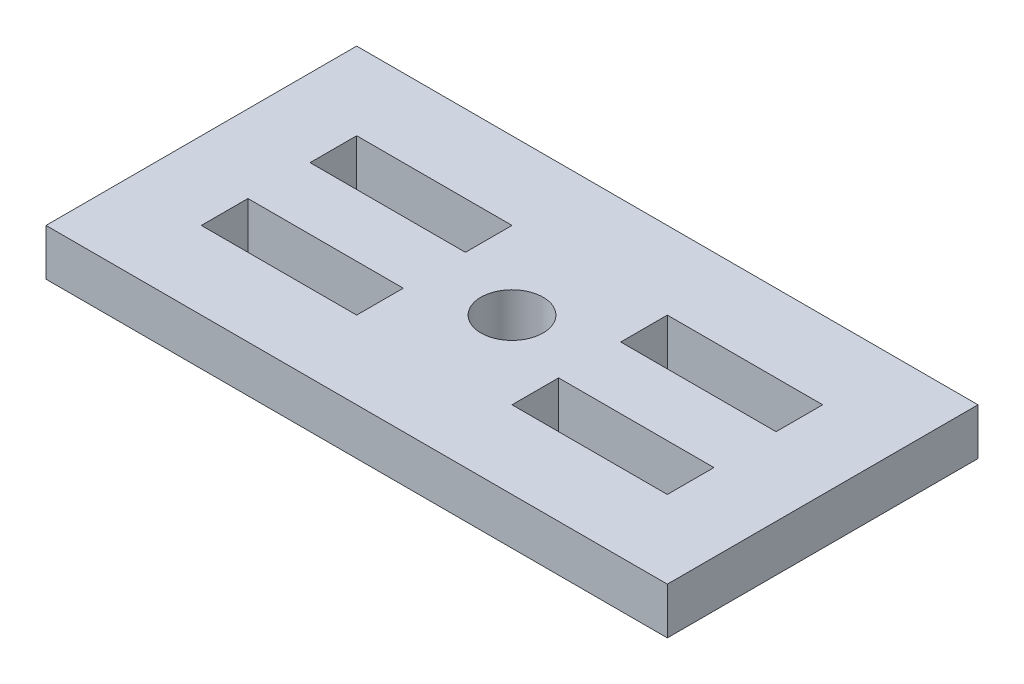
ISO-10303-21;
HEADER;
FILE_DESCRIPTION(('STEP AP214'),'2;1');
FILE_NAME('part.step','',(''),(''),'','','');
FILE_SCHEMA(('AUTOMOTIVE_DESIGN { 1 0 10303 214 1 1 1 1 }'));
ENDSEC;
DATA;
#1=APPLICATION_CONTEXT('core data for automotive mechanical design processes');
#2=APPLICATION_PROTOCOL_DEFINITION('international standard','automotive_design',2000,#1);
#3=PRODUCT_CONTEXT('',#1,'mechanical');
#4=PRODUCT('Part','Part','',(#3));
#5=PRODUCT_RELATED_PRODUCT_CATEGORY('part','',(#4));
#6=PRODUCT_DEFINITION_FORMATION('','',#4);
#7=PRODUCT_DEFINITION_CONTEXT('part definition',#1,'design');
#8=PRODUCT_DEFINITION('design','',#6,#7);
#9=PRODUCT_DEFINITION_SHAPE('','',#8);
#10=(LENGTH_UNIT() NAMED_UNIT(*) SI_UNIT(.MILLI.,.METRE.));
#11=(NAMED_UNIT(*) PLANE_ANGLE_UNIT() SI_UNIT($,.RADIAN.));
#12=(NAMED_UNIT(*) SI_UNIT($,.STERADIAN.) SOLID_ANGLE_UNIT());
#13=UNCERTAINTY_MEASURE_WITH_UNIT(LENGTH_MEASURE(1.E-05),#10,'distance_accuracy_value','');
#14=(GEOMETRIC_REPRESENTATION_CONTEXT(3) GLOBAL_UNCERTAINTY_ASSIGNED_CONTEXT((#13)) GLOBAL_UNIT_ASSIGNED_CONTEXT((#10,
#11,#12)) REPRESENTATION_CONTEXT('',''));
#15=CARTESIAN_POINT('',(0.,0.,0.));
#16=DIRECTION('',(0.,0.,1.));
#17=DIRECTION('',(1.,0.,0.));
#18=AXIS2_PLACEMENT_3D('',#15,#16,#17);
#19=CARTESIAN_POINT('',(-7.72486772486773,1.5,-4.62962962962963));
#20=DIRECTION('',(1.,0.,0.));
#21=DIRECTION('',(0.,0.,-1.));
#22=AXIS2_PLACEMENT_3D('',#19,#20,#21);
#23=PLANE('',#22);
#24=DIRECTION('',(0.,0.,1.));
#25=VECTOR('',#24,1.);
#26=CARTESIAN_POINT('',(-7.72486772486773,0.,-4.62962962962963));
#27=LINE('',#26,#25);
#28=CARTESIAN_POINT('',(-7.72486772486773,0.,-4.62962962962963));
#29=VERTEX_POINT('',#28);
#30=CARTESIAN_POINT('',(-7.72486772486773,0.,5.37037037037037));
#31=VERTEX_POINT('',#30);
#32=EDGE_CURVE('E292',#29,#31,#27,.T.);
#33=ORIENTED_EDGE('',*,*,#32,.T.);
#34=DIRECTION('',(0.,-1.,0.));
#35=VECTOR('',#34,1.);
#36=CARTESIAN_POINT('',(-7.72486772486773,1.5,5.37037037037037));
#37=LINE('',#36,#35);
#38=CARTESIAN_POINT('',(-7.72486772486773,1.5,5.37037037037037));
#39=VERTEX_POINT('',#38);
#40=EDGE_CURVE('E339',#39,#31,#37,.T.);
#41=ORIENTED_EDGE('',*,*,#40,.F.);
#42=DIRECTION('',(0.,0.,1.));
#43=VECTOR('',#42,1.);
#44=CARTESIAN_POINT('',(-7.72486772486773,1.5,-4.62962962962963));
#45=LINE('',#44,#43);
#46=CARTESIAN_POINT('',(-7.72486772486773,1.5,-4.62962962962963));
#47=VERTEX_POINT('',#46);
#48=EDGE_CURVE('E302',#47,#39,#45,.T.);
#49=ORIENTED_EDGE('',*,*,#48,.F.);
#50=DIRECTION('',(0.,-1.,0.));
#51=VECTOR('',#50,1.);
#52=CARTESIAN_POINT('',(-7.72486772486773,1.5,-4.62962962962963));
#53=LINE('',#52,#51);
#54=EDGE_CURVE('E316',#47,#29,#53,.T.);
#55=ORIENTED_EDGE('',*,*,#54,.T.);
#56=EDGE_LOOP('',(#33,#41,#49,#55));
#57=FACE_BOUND('',#56,.T.);
#58=ADVANCED_FACE('F39',(#57),#23,.F.);
#59=CARTESIAN_POINT('',(-7.72486772486773,1.5,5.37037037037037));
#60=DIRECTION('',(0.,0.,-1.));
#61=DIRECTION('',(-1.,0.,0.));
#62=AXIS2_PLACEMENT_3D('',#59,#60,#61);
#63=PLANE('',#62);
#64=DIRECTION('',(1.,0.,0.));
#65=VECTOR('',#64,1.);
#66=CARTESIAN_POINT('',(-7.72486772486773,0.,5.37037037037037));
#67=LINE('',#66,#65);
#68=CARTESIAN_POINT('',(12.2751322751323,0.,5.37037037037037));
#69=VERTEX_POINT('',#68);
#70=EDGE_CURVE('E320',#31,#69,#67,.T.);
#71=ORIENTED_EDGE('',*,*,#70,.T.);
#72=DIRECTION('',(0.,-1.,0.));
#73=VECTOR('',#72,1.);
#74=CARTESIAN_POINT('',(12.2751322751323,1.5,5.37037037037037));
#75=LINE('',#74,#73);
#76=CARTESIAN_POINT('',(12.2751322751323,1.5,5.37037037037037));
#77=VERTEX_POINT('',#76);
#78=EDGE_CURVE('E335',#77,#69,#75,.T.);
#79=ORIENTED_EDGE('',*,*,#78,.F.);
#80=DIRECTION('',(1.,0.,0.));
#81=VECTOR('',#80,1.);
#82=CARTESIAN_POINT('',(-7.72486772486773,1.5,5.37037037037037));
#83=LINE('',#82,#81);
#84=EDGE_CURVE('E306',#39,#77,#83,.T.);
#85=ORIENTED_EDGE('',*,*,#84,.F.);
#86=ORIENTED_EDGE('',*,*,#40,.T.);
#87=EDGE_LOOP('',(#71,#79,#85,#86));
#88=FACE_BOUND('',#87,.T.);
#89=ADVANCED_FACE('F430',(#88),#63,.F.);
#90=CARTESIAN_POINT('',(12.2751322751323,1.5,-4.62962962962963));
#91=DIRECTION('',(-1.,0.,0.));
#92=DIRECTION('',(0.,0.,1.));
#93=AXIS2_PLACEMENT_3D('',#90,#91,#92);
#94=PLANE('',#93);
#95=DIRECTION('',(0.,0.,-1.));
#96=VECTOR('',#95,1.);
#97=CARTESIAN_POINT('',(12.2751322751323,0.,-4.62962962962963));
#98=LINE('',#97,#96);
#99=CARTESIAN_POINT('',(12.2751322751323,0.,-4.62962962962963));
#100=VERTEX_POINT('',#99);
#101=EDGE_CURVE('E323',#69,#100,#98,.T.);
#102=ORIENTED_EDGE('',*,*,#101,.T.);
#103=DIRECTION('',(0.,-1.,0.));
#104=VECTOR('',#103,1.);
#105=CARTESIAN_POINT('',(12.2751322751323,1.5,-4.62962962962963));
#106=LINE('',#105,#104);
#107=CARTESIAN_POINT('',(12.2751322751323,1.5,-4.62962962962963));
#108=VERTEX_POINT('',#107);
#109=EDGE_CURVE('E331',#108,#100,#106,.T.);
#110=ORIENTED_EDGE('',*,*,#109,.F.);
#111=DIRECTION('',(0.,0.,-1.));
#112=VECTOR('',#111,1.);
#113=CARTESIAN_POINT('',(12.2751322751323,1.5,-4.62962962962963));
#114=LINE('',#113,#112);
#115=EDGE_CURVE('E310',#77,#108,#114,.T.);
#116=ORIENTED_EDGE('',*,*,#115,.F.);
#117=ORIENTED_EDGE('',*,*,#78,.T.);
#118=EDGE_LOOP('',(#102,#110,#116,#117));
#119=FACE_BOUND('',#118,.T.);
#120=ADVANCED_FACE('F435',(#119),#94,.F.);
#121=CARTESIAN_POINT('',(-7.72486772486773,1.5,-4.62962962962963));
#122=DIRECTION('',(0.,0.,1.));
#123=DIRECTION('',(1.,0.,0.));
#124=AXIS2_PLACEMENT_3D('',#121,#122,#123);
#125=PLANE('',#124);
#126=DIRECTION('',(-1.,0.,0.));
#127=VECTOR('',#126,1.);
#128=CARTESIAN_POINT('',(-7.72486772486773,0.,-4.62962962962963));
#129=LINE('',#128,#127);
#130=EDGE_CURVE('E307',#100,#29,#129,.T.);
#131=ORIENTED_EDGE('',*,*,#130,.T.);
#132=ORIENTED_EDGE('',*,*,#54,.F.);
#133=DIRECTION('',(-1.,0.,0.));
#134=VECTOR('',#133,1.);
#135=CARTESIAN_POINT('',(-7.72486772486773,1.5,-4.62962962962963));
#136=LINE('',#135,#134);
#137=EDGE_CURVE('E313',#108,#47,#136,.T.);
#138=ORIENTED_EDGE('',*,*,#137,.F.);
#139=ORIENTED_EDGE('',*,*,#109,.T.);
#140=EDGE_LOOP('',(#131,#132,#138,#139));
#141=FACE_BOUND('',#140,.T.);
#142=ADVANCED_FACE('F450',(#141),#125,.F.);
#143=CARTESIAN_POINT('',(0.,1.5,0.));
#144=DIRECTION('',(0.,1.,0.));
#145=DIRECTION('',(0.,0.,1.));
#146=AXIS2_PLACEMENT_3D('',#143,#144,#145);
#147=PLANE('',#146);
#148=CARTESIAN_POINT('',(2.27513227513227,1.5,0.370370370370371));
#149=DIRECTION('',(0.,1.,0.));
#150=DIRECTION('',(0.,0.,1.));
#151=AXIS2_PLACEMENT_3D('',#148,#149,#150);
#152=CIRCLE('',#151,1.);
#153=CARTESIAN_POINT('',(2.27513227513227,1.5,1.37037037037037));
#154=VERTEX_POINT('',#153);
#155=EDGE_CURVE('E610',#154,#154,#152,.T.);
#156=ORIENTED_EDGE('',*,*,#155,.F.);
#157=EDGE_LOOP('',(#156));
#158=FACE_BOUND('',#157,.T.);
#159=DIRECTION('',(0.,0.,-1.));
#160=VECTOR('',#159,1.);
#161=CARTESIAN_POINT('',(-0.224867724867726,1.5,2.87037037037037));
#162=LINE('',#161,#160);
#163=CARTESIAN_POINT('',(-0.224867724867726,1.5,2.87037037037037));
#164=VERTEX_POINT('',#163);
#165=CARTESIAN_POINT('',(-0.224867724867728,1.5,1.37037037037037));
#166=VERTEX_POINT('',#165);
#167=EDGE_CURVE('E55',#164,#166,#162,.T.);
#168=ORIENTED_EDGE('',*,*,#167,.F.);
#169=DIRECTION('',(1.,0.,0.));
#170=VECTOR('',#169,1.);
#171=CARTESIAN_POINT('',(-0.224867724867726,1.5,2.87037037037037));
#172=LINE('',#171,#170);
#173=CARTESIAN_POINT('',(-5.22486772486773,1.5,2.87037037037037));
#174=VERTEX_POINT('',#173);
#175=EDGE_CURVE('E259',#174,#164,#172,.T.);
#176=ORIENTED_EDGE('',*,*,#175,.F.);
#177=DIRECTION('',(0.,0.,1.));
#178=VECTOR('',#177,1.);
#179=CARTESIAN_POINT('',(-5.22486772486773,1.5,2.87037037037037));
#180=LINE('',#179,#178);
#181=CARTESIAN_POINT('',(-5.22486772486773,1.5,1.37037037037037));
#182=VERTEX_POINT('',#181);
#183=EDGE_CURVE('E255',#182,#174,#180,.T.);
#184=ORIENTED_EDGE('',*,*,#183,.F.);
#185=DIRECTION('',(-1.,0.,0.));
#186=VECTOR('',#185,1.);
#187=CARTESIAN_POINT('',(-0.224867724867728,1.5,1.37037037037037));
#188=LINE('',#187,#186);
#189=EDGE_CURVE('E251',#166,#182,#188,.T.);
#190=ORIENTED_EDGE('',*,*,#189,.F.);
#191=EDGE_LOOP('',(#168,#176,#184,#190));
#192=FACE_BOUND('',#191,.T.);
#193=DIRECTION('',(0.,0.,-1.));
#194=VECTOR('',#193,1.);
#195=CARTESIAN_POINT('',(9.77513227513227,1.5,2.87037037037037));
#196=LINE('',#195,#194);
#197=CARTESIAN_POINT('',(9.77513227513227,1.5,2.87037037037037));
#198=VERTEX_POINT('',#197);
#199=CARTESIAN_POINT('',(9.77513227513227,1.5,1.37037037037037));
#200=VERTEX_POINT('',#199);
#201=EDGE_CURVE('E63',#198,#200,#196,.T.);
#202=ORIENTED_EDGE('',*,*,#201,.F.);
#203=DIRECTION('',(1.,0.,0.));
#204=VECTOR('',#203,1.);
#205=CARTESIAN_POINT('',(9.77513227513227,1.5,2.87037037037037));
#206=LINE('',#205,#204);
#207=CARTESIAN_POINT('',(4.77513227513227,1.5,2.87037037037037));
#208=VERTEX_POINT('',#207);
#209=EDGE_CURVE('E233',#208,#198,#206,.T.);
#210=ORIENTED_EDGE('',*,*,#209,.F.);
#211=DIRECTION('',(0.,0.,1.));
#212=VECTOR('',#211,1.);
#213=CARTESIAN_POINT('',(4.77513227513227,1.5,2.87037037037037));
#214=LINE('',#213,#212);
#215=CARTESIAN_POINT('',(4.77513227513227,1.5,1.37037037037037));
#216=VERTEX_POINT('',#215);
#217=EDGE_CURVE('E229',#216,#208,#214,.T.);
#218=ORIENTED_EDGE('',*,*,#217,.F.);
#219=DIRECTION('',(-1.,0.,0.));
#220=VECTOR('',#219,1.);
#221=CARTESIAN_POINT('',(9.77513227513227,1.5,1.37037037037037));
#222=LINE('',#221,#220);
#223=EDGE_CURVE('E224',#200,#216,#222,.T.);
#224=ORIENTED_EDGE('',*,*,#223,.F.);
#225=EDGE_LOOP('',(#202,#210,#218,#224));
#226=FACE_BOUND('',#225,.T.);
#227=DIRECTION('',(0.,0.,1.));
#228=VECTOR('',#227,1.);
#229=CARTESIAN_POINT('',(4.77513227513227,1.5,-0.629629629629629));
#230=LINE('',#229,#228);
#231=CARTESIAN_POINT('',(4.77513227513227,1.5,-2.12962962962964));
#232=VERTEX_POINT('',#231);
#233=CARTESIAN_POINT('',(4.77513227513227,1.5,-0.629629629629629));
#234=VERTEX_POINT('',#233);
#235=EDGE_CURVE('E202',#232,#234,#230,.T.);
#236=ORIENTED_EDGE('',*,*,#235,.F.);
#237=DIRECTION('',(-1.,0.,0.));
#238=VECTOR('',#237,1.);
#239=CARTESIAN_POINT('',(4.77513227513227,1.5,-2.12962962962964));
#240=LINE('',#239,#238);
#241=CARTESIAN_POINT('',(9.77513227513227,1.5,-2.12962962962964));
#242=VERTEX_POINT('',#241);
#243=EDGE_CURVE('E207',#242,#232,#240,.T.);
#244=ORIENTED_EDGE('',*,*,#243,.F.);
#245=DIRECTION('',(0.,0.,-1.));
#246=VECTOR('',#245,1.);
#247=CARTESIAN_POINT('',(9.77513227513227,1.5,-0.62962962962963));
#248=LINE('',#247,#246);
#249=CARTESIAN_POINT('',(9.77513227513227,1.5,-0.62962962962963));
#250=VERTEX_POINT('',#249);
#251=EDGE_CURVE('E184',#250,#242,#248,.T.);
#252=ORIENTED_EDGE('',*,*,#251,.F.);
#253=DIRECTION('',(1.,0.,0.));
#254=VECTOR('',#253,1.);
#255=CARTESIAN_POINT('',(4.77513227513227,1.5,-0.629629629629629));
#256=LINE('',#255,#254);
#257=EDGE_CURVE('E196',#234,#250,#256,.T.);
#258=ORIENTED_EDGE('',*,*,#257,.F.);
#259=EDGE_LOOP('',(#236,#244,#252,#258));
#260=FACE_BOUND('',#259,.T.);
#261=DIRECTION('',(0.,0.,1.));
#262=VECTOR('',#261,1.);
#263=CARTESIAN_POINT('',(-5.22486772486773,1.5,-2.12962962962963));
#264=LINE('',#263,#262);
#265=CARTESIAN_POINT('',(-5.22486772486773,1.5,-2.12962962962963));
#266=VERTEX_POINT('',#265);
#267=CARTESIAN_POINT('',(-5.22486772486773,1.5,-0.629629629629629));
#268=VERTEX_POINT('',#267);
#269=EDGE_CURVE('E217',#266,#268,#264,.T.);
#270=ORIENTED_EDGE('',*,*,#269,.F.);
#271=DIRECTION('',(-1.,0.,0.));
#272=VECTOR('',#271,1.);
#273=CARTESIAN_POINT('',(-5.22486772486773,1.5,-2.12962962962963));
#274=LINE('',#273,#272);
#275=CARTESIAN_POINT('',(-0.224867724867729,1.5,-2.12962962962963));
#276=VERTEX_POINT('',#275);
#277=EDGE_CURVE('E284',#276,#266,#274,.T.);
#278=ORIENTED_EDGE('',*,*,#277,.F.);
#279=DIRECTION('',(0.,0.,-1.));
#280=VECTOR('',#279,1.);
#281=CARTESIAN_POINT('',(-0.224867724867729,1.5,-2.12962962962963));
#282=LINE('',#281,#280);
#283=CARTESIAN_POINT('',(-0.224867724867728,1.5,-0.629629629629629));
#284=VERTEX_POINT('',#283);
#285=EDGE_CURVE('E280',#284,#276,#282,.T.);
#286=ORIENTED_EDGE('',*,*,#285,.F.);
#287=DIRECTION('',(1.,0.,0.));
#288=VECTOR('',#287,1.);
#289=CARTESIAN_POINT('',(-5.22486772486773,1.5,-0.629629629629629));
#290=LINE('',#289,#288);
#291=EDGE_CURVE('E276',#268,#284,#290,.T.);
#292=ORIENTED_EDGE('',*,*,#291,.F.);
#293=EDGE_LOOP('',(#270,#278,#286,#292));
#294=FACE_BOUND('',#293,.T.);
#295=ORIENTED_EDGE('',*,*,#48,.T.);
#296=ORIENTED_EDGE('',*,*,#84,.T.);
#297=ORIENTED_EDGE('',*,*,#115,.T.);
#298=ORIENTED_EDGE('',*,*,#137,.T.);
#299=EDGE_LOOP('',(#295,#296,#297,#298));
#300=FACE_BOUND('',#299,.T.);
#301=ADVANCED_FACE('F204',(#158,#192,#226,#260,#294,#300),#147,.T.);
#302=CARTESIAN_POINT('',(0.,0.,0.));
#303=DIRECTION('',(0.,1.,0.));
#304=DIRECTION('',(0.,0.,1.));
#305=AXIS2_PLACEMENT_3D('',#302,#303,#304);
#306=PLANE('',#305);
#307=CARTESIAN_POINT('',(2.27513227513227,0.,0.370370370370371));
#308=DIRECTION('',(0.,1.,0.));
#309=DIRECTION('',(0.,0.,1.));
#310=AXIS2_PLACEMENT_3D('',#307,#308,#309);
#311=CIRCLE('',#310,1.);
#312=CARTESIAN_POINT('',(2.27513227513227,0.,1.37037037037037));
#313=VERTEX_POINT('',#312);
#314=EDGE_CURVE('E42',#313,#313,#311,.T.);
#315=ORIENTED_EDGE('',*,*,#314,.T.);
#316=EDGE_LOOP('',(#315));
#317=FACE_BOUND('',#316,.T.);
#318=DIRECTION('',(1.,0.,0.));
#319=VECTOR('',#318,1.);
#320=CARTESIAN_POINT('',(0.,0.,2.87037037037037));
#321=LINE('',#320,#319);
#322=CARTESIAN_POINT('',(-5.22486772486773,0.,2.87037037037037));
#323=VERTEX_POINT('',#322);
#324=CARTESIAN_POINT('',(-0.224867724867726,0.,2.87037037037037));
#325=VERTEX_POINT('',#324);
#326=EDGE_CURVE('E48',#323,#325,#321,.T.);
#327=ORIENTED_EDGE('',*,*,#326,.T.);
#328=DIRECTION('',(0.,0.,-1.));
#329=VECTOR('',#328,1.);
#330=CARTESIAN_POINT('',(-0.224867724867729,0.,0.));
#331=LINE('',#330,#329);
#332=CARTESIAN_POINT('',(-0.224867724867728,0.,1.37037037037037));
#333=VERTEX_POINT('',#332);
#334=EDGE_CURVE('E11',#325,#333,#331,.T.);
#335=ORIENTED_EDGE('',*,*,#334,.T.);
#336=DIRECTION('',(-1.,0.,0.));
#337=VECTOR('',#336,1.);
#338=CARTESIAN_POINT('',(0.,0.,1.37037037037037));
#339=LINE('',#338,#337);
#340=CARTESIAN_POINT('',(-5.22486772486773,0.,1.37037037037037));
#341=VERTEX_POINT('',#340);
#342=EDGE_CURVE('E388',#333,#341,#339,.T.);
#343=ORIENTED_EDGE('',*,*,#342,.T.);
#344=DIRECTION('',(0.,0.,1.));
#345=VECTOR('',#344,1.);
#346=CARTESIAN_POINT('',(-5.22486772486773,0.,0.));
#347=LINE('',#346,#345);
#348=EDGE_CURVE('E392',#341,#323,#347,.T.);
#349=ORIENTED_EDGE('',*,*,#348,.T.);
#350=EDGE_LOOP('',(#327,#335,#343,#349));
#351=FACE_BOUND('',#350,.T.);
#352=DIRECTION('',(1.,0.,0.));
#353=VECTOR('',#352,1.);
#354=CARTESIAN_POINT('',(0.,0.,2.87037037037037));
#355=LINE('',#354,#353);
#356=CARTESIAN_POINT('',(4.77513227513227,0.,2.87037037037037));
#357=VERTEX_POINT('',#356);
#358=CARTESIAN_POINT('',(9.77513227513227,0.,2.87037037037037));
#359=VERTEX_POINT('',#358);
#360=EDGE_CURVE('E380',#357,#359,#355,.T.);
#361=ORIENTED_EDGE('',*,*,#360,.T.);
#362=DIRECTION('',(0.,0.,-1.));
#363=VECTOR('',#362,1.);
#364=CARTESIAN_POINT('',(9.77513227513227,0.,0.));
#365=LINE('',#364,#363);
#366=CARTESIAN_POINT('',(9.77513227513227,0.,1.37037037037037));
#367=VERTEX_POINT('',#366);
#368=EDGE_CURVE('E384',#359,#367,#365,.T.);
#369=ORIENTED_EDGE('',*,*,#368,.T.);
#370=DIRECTION('',(-1.,0.,0.));
#371=VECTOR('',#370,1.);
#372=CARTESIAN_POINT('',(0.,0.,1.37037037037037));
#373=LINE('',#372,#371);
#374=CARTESIAN_POINT('',(4.77513227513227,0.,1.37037037037037));
#375=VERTEX_POINT('',#374);
#376=EDGE_CURVE('E372',#367,#375,#373,.T.);
#377=ORIENTED_EDGE('',*,*,#376,.T.);
#378=DIRECTION('',(0.,0.,1.));
#379=VECTOR('',#378,1.);
#380=CARTESIAN_POINT('',(4.77513227513227,0.,0.));
#381=LINE('',#380,#379);
#382=EDGE_CURVE('E376',#375,#357,#381,.T.);
#383=ORIENTED_EDGE('',*,*,#382,.T.);
#384=EDGE_LOOP('',(#361,#369,#377,#383));
#385=FACE_BOUND('',#384,.T.);
#386=DIRECTION('',(-1.,0.,0.));
#387=VECTOR('',#386,1.);
#388=CARTESIAN_POINT('',(0.,0.,-2.12962962962963));
#389=LINE('',#388,#387);
#390=CARTESIAN_POINT('',(9.77513227513227,0.,-2.12962962962964));
#391=VERTEX_POINT('',#390);
#392=CARTESIAN_POINT('',(4.77513227513227,0.,-2.12962962962964));
#393=VERTEX_POINT('',#392);
#394=EDGE_CURVE('E364',#391,#393,#389,.T.);
#395=ORIENTED_EDGE('',*,*,#394,.T.);
#396=DIRECTION('',(0.,0.,1.));
#397=VECTOR('',#396,1.);
#398=CARTESIAN_POINT('',(4.77513227513227,0.,0.));
#399=LINE('',#398,#397);
#400=CARTESIAN_POINT('',(4.77513227513227,0.,-0.629629629629629));
#401=VERTEX_POINT('',#400);
#402=EDGE_CURVE('E368',#393,#401,#399,.T.);
#403=ORIENTED_EDGE('',*,*,#402,.T.);
#404=DIRECTION('',(1.,0.,0.));
#405=VECTOR('',#404,1.);
#406=CARTESIAN_POINT('',(0.,0.,-0.629629629629629));
#407=LINE('',#406,#405);
#408=CARTESIAN_POINT('',(9.77513227513227,0.,-0.62962962962963));
#409=VERTEX_POINT('',#408);
#410=EDGE_CURVE('E359',#401,#409,#407,.T.);
#411=ORIENTED_EDGE('',*,*,#410,.T.);
#412=DIRECTION('',(0.,0.,-1.));
#413=VECTOR('',#412,1.);
#414=CARTESIAN_POINT('',(9.77513227513227,0.,0.));
#415=LINE('',#414,#413);
#416=EDGE_CURVE('E187',#409,#391,#415,.T.);
#417=ORIENTED_EDGE('',*,*,#416,.T.);
#418=EDGE_LOOP('',(#395,#403,#411,#417));
#419=FACE_BOUND('',#418,.T.);
#420=DIRECTION('',(-1.,0.,0.));
#421=VECTOR('',#420,1.);
#422=CARTESIAN_POINT('',(0.,0.,-2.12962962962963));
#423=LINE('',#422,#421);
#424=CARTESIAN_POINT('',(-0.224867724867729,0.,-2.12962962962963));
#425=VERTEX_POINT('',#424);
#426=CARTESIAN_POINT('',(-5.22486772486773,0.,-2.12962962962963));
#427=VERTEX_POINT('',#426);
#428=EDGE_CURVE('E351',#425,#427,#423,.T.);
#429=ORIENTED_EDGE('',*,*,#428,.T.);
#430=DIRECTION('',(0.,0.,1.));
#431=VECTOR('',#430,1.);
#432=CARTESIAN_POINT('',(-5.22486772486773,0.,0.));
#433=LINE('',#432,#431);
#434=CARTESIAN_POINT('',(-5.22486772486773,0.,-0.629629629629629));
#435=VERTEX_POINT('',#434);
#436=EDGE_CURVE('E355',#427,#435,#433,.T.);
#437=ORIENTED_EDGE('',*,*,#436,.T.);
#438=DIRECTION('',(1.,0.,0.));
#439=VECTOR('',#438,1.);
#440=CARTESIAN_POINT('',(0.,0.,-0.629629629629629));
#441=LINE('',#440,#439);
#442=CARTESIAN_POINT('',(-0.224867724867728,0.,-0.629629629629629));
#443=VERTEX_POINT('',#442);
#444=EDGE_CURVE('E343',#435,#443,#441,.T.);
#445=ORIENTED_EDGE('',*,*,#444,.T.);
#446=DIRECTION('',(0.,0.,-1.));
#447=VECTOR('',#446,1.);
#448=CARTESIAN_POINT('',(-0.224867724867728,0.,0.));
#449=LINE('',#448,#447);
#450=EDGE_CURVE('E347',#443,#425,#449,.T.);
#451=ORIENTED_EDGE('',*,*,#450,.T.);
#452=EDGE_LOOP('',(#429,#437,#445,#451));
#453=FACE_BOUND('',#452,.T.);
#454=ORIENTED_EDGE('',*,*,#32,.F.);
#455=ORIENTED_EDGE('',*,*,#130,.F.);
#456=ORIENTED_EDGE('',*,*,#101,.F.);
#457=ORIENTED_EDGE('',*,*,#70,.F.);
#458=EDGE_LOOP('',(#454,#455,#456,#457));
#459=FACE_BOUND('',#458,.T.);
#460=ADVANCED_FACE('F399',(#317,#351,#385,#419,#453,#459),#306,.F.);
#461=CARTESIAN_POINT('',(-5.22486772486773,-0.5,-2.12962962962963));
#462=DIRECTION('',(-1.,0.,0.));
#463=DIRECTION('',(0.,0.,1.));
#464=AXIS2_PLACEMENT_3D('',#461,#462,#463);
#465=PLANE('',#464);
#466=DIRECTION('',(0.,1.,0.));
#467=VECTOR('',#466,1.);
#468=CARTESIAN_POINT('',(-5.22486772486773,-0.5,-2.12962962962963));
#469=LINE('',#468,#467);
#470=EDGE_CURVE('E289',#427,#266,#469,.T.);
#471=ORIENTED_EDGE('',*,*,#470,.T.);
#472=ORIENTED_EDGE('',*,*,#269,.T.);
#473=DIRECTION('',(0.,1.,0.));
#474=VECTOR('',#473,1.);
#475=CARTESIAN_POINT('',(-5.22486772486773,-0.5,-0.629629629629629));
#476=LINE('',#475,#474);
#477=EDGE_CURVE('E288',#435,#268,#476,.T.);
#478=ORIENTED_EDGE('',*,*,#477,.F.);
#479=ORIENTED_EDGE('',*,*,#436,.F.);
#480=EDGE_LOOP('',(#471,#472,#478,#479));
#481=FACE_BOUND('',#480,.T.);
#482=ADVANCED_FACE('F461',(#481),#465,.F.);
#483=CARTESIAN_POINT('',(-5.22486772486773,-0.5,-2.12962962962963));
#484=DIRECTION('',(0.,0.,-1.));
#485=DIRECTION('',(-1.,0.,0.));
#486=AXIS2_PLACEMENT_3D('',#483,#484,#485);
#487=PLANE('',#486);
#488=DIRECTION('',(0.,1.,0.));
#489=VECTOR('',#488,1.);
#490=CARTESIAN_POINT('',(-0.224867724867729,-0.5,-2.12962962962963));
#491=LINE('',#490,#489);
#492=EDGE_CURVE('E293',#425,#276,#491,.T.);
#493=ORIENTED_EDGE('',*,*,#492,.T.);
#494=ORIENTED_EDGE('',*,*,#277,.T.);
#495=ORIENTED_EDGE('',*,*,#470,.F.);
#496=ORIENTED_EDGE('',*,*,#428,.F.);
#497=EDGE_LOOP('',(#493,#494,#495,#496));
#498=FACE_BOUND('',#497,.T.);
#499=ADVANCED_FACE('F468',(#498),#487,.F.);
#500=CARTESIAN_POINT('',(-0.224867724867729,-0.5,-2.12962962962963));
#501=DIRECTION('',(1.,0.,0.));
#502=DIRECTION('',(0.,0.,-1.));
#503=AXIS2_PLACEMENT_3D('',#500,#501,#502);
#504=PLANE('',#503);
#505=DIRECTION('',(0.,1.,0.));
#506=VECTOR('',#505,1.);
#507=CARTESIAN_POINT('',(-0.224867724867728,-0.5,-0.629629629629629));
#508=LINE('',#507,#506);
#509=EDGE_CURVE('E296',#443,#284,#508,.T.);
#510=ORIENTED_EDGE('',*,*,#509,.T.);
#511=ORIENTED_EDGE('',*,*,#285,.T.);
#512=ORIENTED_EDGE('',*,*,#492,.F.);
#513=ORIENTED_EDGE('',*,*,#450,.F.);
#514=EDGE_LOOP('',(#510,#511,#512,#513));
#515=FACE_BOUND('',#514,.T.);
#516=ADVANCED_FACE('F474',(#515),#504,.F.);
#517=CARTESIAN_POINT('',(-5.22486772486773,-0.5,-0.629629629629629));
#518=DIRECTION('',(0.,0.,1.));
#519=DIRECTION('',(1.,0.,0.));
#520=AXIS2_PLACEMENT_3D('',#517,#518,#519);
#521=PLANE('',#520);
#522=ORIENTED_EDGE('',*,*,#477,.T.);
#523=ORIENTED_EDGE('',*,*,#291,.T.);
#524=ORIENTED_EDGE('',*,*,#509,.F.);
#525=ORIENTED_EDGE('',*,*,#444,.F.);
#526=EDGE_LOOP('',(#522,#523,#524,#525));
#527=FACE_BOUND('',#526,.T.);
#528=ADVANCED_FACE('F470',(#527),#521,.F.);
#529=CARTESIAN_POINT('',(4.77513227513227,-0.5,-0.629629629629629));
#530=DIRECTION('',(-1.,0.,0.));
#531=DIRECTION('',(0.,0.,1.));
#532=AXIS2_PLACEMENT_3D('',#529,#530,#531);
#533=PLANE('',#532);
#534=DIRECTION('',(0.,1.,0.));
#535=VECTOR('',#534,1.);
#536=CARTESIAN_POINT('',(4.77513227513227,-0.5,-2.12962962962964));
#537=LINE('',#536,#535);
#538=EDGE_CURVE('E214',#393,#232,#537,.T.);
#539=ORIENTED_EDGE('',*,*,#538,.T.);
#540=ORIENTED_EDGE('',*,*,#235,.T.);
#541=DIRECTION('',(0.,1.,0.));
#542=VECTOR('',#541,1.);
#543=CARTESIAN_POINT('',(4.77513227513227,-0.5,-0.629629629629629));
#544=LINE('',#543,#542);
#545=EDGE_CURVE('E192',#401,#234,#544,.T.);
#546=ORIENTED_EDGE('',*,*,#545,.F.);
#547=ORIENTED_EDGE('',*,*,#402,.F.);
#548=EDGE_LOOP('',(#539,#540,#546,#547));
#549=FACE_BOUND('',#548,.T.);
#550=ADVANCED_FACE('F473',(#549),#533,.F.);
#551=CARTESIAN_POINT('',(4.77513227513227,-0.5,-2.12962962962964));
#552=DIRECTION('',(0.,0.,-1.));
#553=DIRECTION('',(-1.,0.,0.));
#554=AXIS2_PLACEMENT_3D('',#551,#552,#553);
#555=PLANE('',#554);
#556=DIRECTION('',(0.,1.,0.));
#557=VECTOR('',#556,1.);
#558=CARTESIAN_POINT('',(9.77513227513227,-0.5,-2.12962962962964));
#559=LINE('',#558,#557);
#560=EDGE_CURVE('E191',#391,#242,#559,.T.);
#561=ORIENTED_EDGE('',*,*,#560,.T.);
#562=ORIENTED_EDGE('',*,*,#243,.T.);
#563=ORIENTED_EDGE('',*,*,#538,.F.);
#564=ORIENTED_EDGE('',*,*,#394,.F.);
#565=EDGE_LOOP('',(#561,#562,#563,#564));
#566=FACE_BOUND('',#565,.T.);
#567=ADVANCED_FACE('F507',(#566),#555,.F.);
#568=CARTESIAN_POINT('',(9.77513227513227,-0.5,-0.62962962962963));
#569=DIRECTION('',(1.,0.,0.));
#570=DIRECTION('',(0.,0.,-1.));
#571=AXIS2_PLACEMENT_3D('',#568,#569,#570);
#572=PLANE('',#571);
#573=DIRECTION('',(0.,1.,0.));
#574=VECTOR('',#573,1.);
#575=CARTESIAN_POINT('',(9.77513227513227,-0.5,-0.62962962962963));
#576=LINE('',#575,#574);
#577=EDGE_CURVE('E179',#409,#250,#576,.T.);
#578=ORIENTED_EDGE('',*,*,#577,.T.);
#579=ORIENTED_EDGE('',*,*,#251,.T.);
#580=ORIENTED_EDGE('',*,*,#560,.F.);
#581=ORIENTED_EDGE('',*,*,#416,.F.);
#582=EDGE_LOOP('',(#578,#579,#580,#581));
#583=FACE_BOUND('',#582,.T.);
#584=ADVANCED_FACE('F181',(#583),#572,.F.);
#585=CARTESIAN_POINT('',(4.77513227513227,-0.5,-0.629629629629629));
#586=DIRECTION('',(0.,0.,1.));
#587=DIRECTION('',(1.,0.,0.));
#588=AXIS2_PLACEMENT_3D('',#585,#586,#587);
#589=PLANE('',#588);
#590=ORIENTED_EDGE('',*,*,#545,.T.);
#591=ORIENTED_EDGE('',*,*,#257,.T.);
#592=ORIENTED_EDGE('',*,*,#577,.F.);
#593=ORIENTED_EDGE('',*,*,#410,.F.);
#594=EDGE_LOOP('',(#590,#591,#592,#593));
#595=FACE_BOUND('',#594,.T.);
#596=ADVANCED_FACE('F197',(#595),#589,.F.);
#597=CARTESIAN_POINT('',(9.77513227513227,-0.5,2.87037037037037));
#598=DIRECTION('',(1.,0.,0.));
#599=DIRECTION('',(0.,0.,-1.));
#600=AXIS2_PLACEMENT_3D('',#597,#598,#599);
#601=PLANE('',#600);
#602=DIRECTION('',(0.,1.,0.));
#603=VECTOR('',#602,1.);
#604=CARTESIAN_POINT('',(9.77513227513227,-0.5,2.87037037037037));
#605=LINE('',#604,#603);
#606=EDGE_CURVE('E238',#359,#198,#605,.T.);
#607=ORIENTED_EDGE('',*,*,#606,.T.);
#608=ORIENTED_EDGE('',*,*,#201,.T.);
#609=DIRECTION('',(0.,1.,0.));
#610=VECTOR('',#609,1.);
#611=CARTESIAN_POINT('',(9.77513227513227,-0.5,1.37037037037037));
#612=LINE('',#611,#610);
#613=EDGE_CURVE('E237',#367,#200,#612,.T.);
#614=ORIENTED_EDGE('',*,*,#613,.F.);
#615=ORIENTED_EDGE('',*,*,#368,.F.);
#616=EDGE_LOOP('',(#607,#608,#614,#615));
#617=FACE_BOUND('',#616,.T.);
#618=ADVANCED_FACE('F528',(#617),#601,.F.);
#619=CARTESIAN_POINT('',(9.77513227513227,-0.5,2.87037037037037));
#620=DIRECTION('',(0.,0.,1.));
#621=DIRECTION('',(1.,0.,0.));
#622=AXIS2_PLACEMENT_3D('',#619,#620,#621);
#623=PLANE('',#622);
#624=DIRECTION('',(0.,1.,0.));
#625=VECTOR('',#624,1.);
#626=CARTESIAN_POINT('',(4.77513227513227,-0.5,2.87037037037037));
#627=LINE('',#626,#625);
#628=EDGE_CURVE('E241',#357,#208,#627,.T.);
#629=ORIENTED_EDGE('',*,*,#628,.T.);
#630=ORIENTED_EDGE('',*,*,#209,.T.);
#631=ORIENTED_EDGE('',*,*,#606,.F.);
#632=ORIENTED_EDGE('',*,*,#360,.F.);
#633=EDGE_LOOP('',(#629,#630,#631,#632));
#634=FACE_BOUND('',#633,.T.);
#635=ADVANCED_FACE('F535',(#634),#623,.F.);
#636=CARTESIAN_POINT('',(4.77513227513227,-0.5,2.87037037037037));
#637=DIRECTION('',(-1.,0.,0.));
#638=DIRECTION('',(0.,0.,1.));
#639=AXIS2_PLACEMENT_3D('',#636,#637,#638);
#640=PLANE('',#639);
#641=DIRECTION('',(0.,1.,0.));
#642=VECTOR('',#641,1.);
#643=CARTESIAN_POINT('',(4.77513227513227,-0.5,1.37037037037037));
#644=LINE('',#643,#642);
#645=EDGE_CURVE('E244',#375,#216,#644,.T.);
#646=ORIENTED_EDGE('',*,*,#645,.T.);
#647=ORIENTED_EDGE('',*,*,#217,.T.);
#648=ORIENTED_EDGE('',*,*,#628,.F.);
#649=ORIENTED_EDGE('',*,*,#382,.F.);
#650=EDGE_LOOP('',(#646,#647,#648,#649));
#651=FACE_BOUND('',#650,.T.);
#652=ADVANCED_FACE('F424',(#651),#640,.F.);
#653=CARTESIAN_POINT('',(9.77513227513227,-0.5,1.37037037037037));
#654=DIRECTION('',(0.,0.,-1.));
#655=DIRECTION('',(-1.,0.,0.));
#656=AXIS2_PLACEMENT_3D('',#653,#654,#655);
#657=PLANE('',#656);
#658=ORIENTED_EDGE('',*,*,#613,.T.);
#659=ORIENTED_EDGE('',*,*,#223,.T.);
#660=ORIENTED_EDGE('',*,*,#645,.F.);
#661=ORIENTED_EDGE('',*,*,#376,.F.);
#662=EDGE_LOOP('',(#658,#659,#660,#661));
#663=FACE_BOUND('',#662,.T.);
#664=ADVANCED_FACE('F417',(#663),#657,.F.);
#665=CARTESIAN_POINT('',(-0.224867724867726,-0.5,2.87037037037037));
#666=DIRECTION('',(1.,0.,0.));
#667=DIRECTION('',(0.,0.,-1.));
#668=AXIS2_PLACEMENT_3D('',#665,#666,#667);
#669=PLANE('',#668);
#670=DIRECTION('',(0.,1.,0.));
#671=VECTOR('',#670,1.);
#672=CARTESIAN_POINT('',(-0.224867724867726,-0.5,2.87037037037037));
#673=LINE('',#672,#671);
#674=EDGE_CURVE('E225',#325,#164,#673,.T.);
#675=ORIENTED_EDGE('',*,*,#674,.T.);
#676=ORIENTED_EDGE('',*,*,#167,.T.);
#677=DIRECTION('',(0.,1.,0.));
#678=VECTOR('',#677,1.);
#679=CARTESIAN_POINT('',(-0.224867724867728,-0.5,1.37037037037037));
#680=LINE('',#679,#678);
#681=EDGE_CURVE('E263',#333,#166,#680,.T.);
#682=ORIENTED_EDGE('',*,*,#681,.F.);
#683=ORIENTED_EDGE('',*,*,#334,.F.);
#684=EDGE_LOOP('',(#675,#676,#682,#683));
#685=FACE_BOUND('',#684,.T.);
#686=ADVANCED_FACE('F415',(#685),#669,.F.);
#687=CARTESIAN_POINT('',(-0.224867724867726,-0.5,2.87037037037037));
#688=DIRECTION('',(0.,0.,1.));
#689=DIRECTION('',(1.,0.,0.));
#690=AXIS2_PLACEMENT_3D('',#687,#688,#689);
#691=PLANE('',#690);
#692=DIRECTION('',(0.,1.,0.));
#693=VECTOR('',#692,1.);
#694=CARTESIAN_POINT('',(-5.22486772486773,-0.5,2.87037037037037));
#695=LINE('',#694,#693);
#696=EDGE_CURVE('E266',#323,#174,#695,.T.);
#697=ORIENTED_EDGE('',*,*,#696,.T.);
#698=ORIENTED_EDGE('',*,*,#175,.T.);
#699=ORIENTED_EDGE('',*,*,#674,.F.);
#700=ORIENTED_EDGE('',*,*,#326,.F.);
#701=EDGE_LOOP('',(#697,#698,#699,#700));
#702=FACE_BOUND('',#701,.T.);
#703=ADVANCED_FACE('F405',(#702),#691,.F.);
#704=CARTESIAN_POINT('',(-5.22486772486773,-0.5,2.87037037037037));
#705=DIRECTION('',(-1.,0.,0.));
#706=DIRECTION('',(0.,0.,1.));
#707=AXIS2_PLACEMENT_3D('',#704,#705,#706);
#708=PLANE('',#707);
#709=DIRECTION('',(0.,1.,0.));
#710=VECTOR('',#709,1.);
#711=CARTESIAN_POINT('',(-5.22486772486773,-0.5,1.37037037037037));
#712=LINE('',#711,#710);
#713=EDGE_CURVE('E269',#341,#182,#712,.T.);
#714=ORIENTED_EDGE('',*,*,#713,.T.);
#715=ORIENTED_EDGE('',*,*,#183,.T.);
#716=ORIENTED_EDGE('',*,*,#696,.F.);
#717=ORIENTED_EDGE('',*,*,#348,.F.);
#718=EDGE_LOOP('',(#714,#715,#716,#717));
#719=FACE_BOUND('',#718,.T.);
#720=ADVANCED_FACE('F407',(#719),#708,.F.);
#721=CARTESIAN_POINT('',(-0.224867724867728,-0.5,1.37037037037037));
#722=DIRECTION('',(0.,0.,-1.));
#723=DIRECTION('',(-1.,0.,0.));
#724=AXIS2_PLACEMENT_3D('',#721,#722,#723);
#725=PLANE('',#724);
#726=ORIENTED_EDGE('',*,*,#681,.T.);
#727=ORIENTED_EDGE('',*,*,#189,.T.);
#728=ORIENTED_EDGE('',*,*,#713,.F.);
#729=ORIENTED_EDGE('',*,*,#342,.F.);
#730=EDGE_LOOP('',(#726,#727,#728,#729));
#731=FACE_BOUND('',#730,.T.);
#732=ADVANCED_FACE('F414',(#731),#725,.F.);
#733=CARTESIAN_POINT('',(2.27513227513227,-0.5,0.370370370370371));
#734=DIRECTION('',(0.,1.,0.));
#735=DIRECTION('',(0.,0.,1.));
#736=AXIS2_PLACEMENT_3D('',#733,#734,#735);
#737=CYLINDRICAL_SURFACE('',#736,1.);
#738=ORIENTED_EDGE('',*,*,#155,.T.);
#739=EDGE_LOOP('',(#738));
#740=FACE_BOUND('',#739,.T.);
#741=ORIENTED_EDGE('',*,*,#314,.F.);
#742=EDGE_LOOP('',(#741));
#743=FACE_BOUND('',#742,.T.);
#744=ADVANCED_FACE('F581',(#740,#743),#737,.F.);
#745=CLOSED_SHELL('',(#58,#89,#120,#142,#301,#460,#482,#499,#516,#528,#550,#567,#584,#596,#618,
#635,#652,#664,#686,#703,#720,#732,#744));
#746=MANIFOLD_SOLID_BREP('B2',#745);
#747=ADVANCED_BREP_SHAPE_REPRESENTATION('',(#18,#746),#14);
#748=SHAPE_DEFINITION_REPRESENTATION(#9,#747);
ENDSEC;
END-ISO-10303-21;
